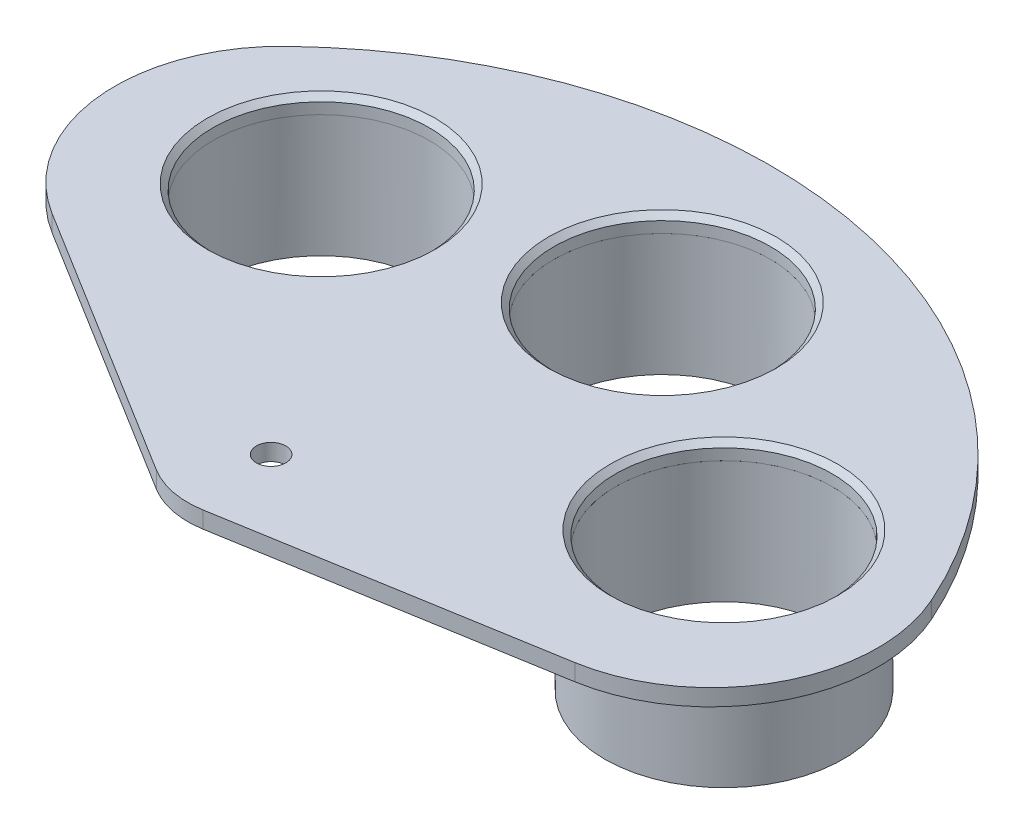
ISO-10303-21;
HEADER;
FILE_DESCRIPTION(('STEP AP214'),'2;1');
FILE_NAME('part.step','',(''),(''),'','','');
FILE_SCHEMA(('AUTOMOTIVE_DESIGN { 1 0 10303 214 1 1 1 1 }'));
ENDSEC;
DATA;
#1=APPLICATION_CONTEXT('core data for automotive mechanical design processes');
#2=APPLICATION_PROTOCOL_DEFINITION('international standard','automotive_design',2000,#1);
#3=PRODUCT_CONTEXT('',#1,'mechanical');
#4=PRODUCT('Part','Part','',(#3));
#5=PRODUCT_RELATED_PRODUCT_CATEGORY('part','',(#4));
#6=PRODUCT_DEFINITION_FORMATION('','',#4);
#7=PRODUCT_DEFINITION_CONTEXT('part definition',#1,'design');
#8=PRODUCT_DEFINITION('design','',#6,#7);
#9=PRODUCT_DEFINITION_SHAPE('','',#8);
#10=(LENGTH_UNIT() NAMED_UNIT(*) SI_UNIT(.MILLI.,.METRE.));
#11=(NAMED_UNIT(*) PLANE_ANGLE_UNIT() SI_UNIT($,.RADIAN.));
#12=(NAMED_UNIT(*) SI_UNIT($,.STERADIAN.) SOLID_ANGLE_UNIT());
#13=UNCERTAINTY_MEASURE_WITH_UNIT(LENGTH_MEASURE(1.E-05),#10,'distance_accuracy_value','');
#14=(GEOMETRIC_REPRESENTATION_CONTEXT(3) GLOBAL_UNCERTAINTY_ASSIGNED_CONTEXT((#13)) GLOBAL_UNIT_ASSIGNED_CONTEXT((#10,
#11,#12)) REPRESENTATION_CONTEXT('',''));
#15=CARTESIAN_POINT('',(0.,0.,0.));
#16=DIRECTION('',(0.,0.,1.));
#17=DIRECTION('',(1.,0.,0.));
#18=AXIS2_PLACEMENT_3D('',#15,#16,#17);
#19=CARTESIAN_POINT('',(52.526183946676,-3.,-28.9999999999992));
#20=DIRECTION('',(0.,1.,0.));
#21=DIRECTION('',(-0.984807753012207,0.,-0.173648177666934));
#22=AXIS2_PLACEMENT_3D('',#19,#20,#21);
#23=PLANE('',#22);
#24=CARTESIAN_POINT('',(52.526183946676,-3.,-28.9999999999992));
#25=DIRECTION('',(0.,1.,0.));
#26=DIRECTION('',(-0.984807753012207,0.,-0.173648177666934));
#27=AXIS2_PLACEMENT_3D('',#24,#25,#26);
#28=CIRCLE('',#27,24.);
#29=CARTESIAN_POINT('',(28.890797874383,-3.,-33.1675562640056));
#30=VERTEX_POINT('',#29);
#31=EDGE_CURVE('E61',#30,#30,#28,.T.);
#32=ORIENTED_EDGE('',*,*,#31,.F.);
#33=EDGE_LOOP('',(#32));
#34=FACE_BOUND('',#33,.T.);
#35=CARTESIAN_POINT('',(52.526183946676,-3.,-28.9999999999992));
#36=DIRECTION('',(0.,1.,0.));
#37=DIRECTION('',(-0.984807753012207,0.,-0.173648177666934));
#38=AXIS2_PLACEMENT_3D('',#35,#36,#37);
#39=CIRCLE('',#38,21.4999999999999);
#40=CARTESIAN_POINT('',(31.3528172569136,-3.,-32.7334358198383));
#41=VERTEX_POINT('',#40);
#42=EDGE_CURVE('E11',#41,#41,#39,.F.);
#43=ORIENTED_EDGE('',*,*,#42,.F.);
#44=EDGE_LOOP('',(#43));
#45=FACE_BOUND('',#44,.T.);
#46=ADVANCED_FACE('F52',(#34,#45),#23,.F.);
#47=CARTESIAN_POINT('',(52.526183946676,-3.,-28.9999999999992));
#48=DIRECTION('',(0.,1.,0.));
#49=DIRECTION('',(-0.984807753012207,0.,-0.173648177666934));
#50=AXIS2_PLACEMENT_3D('',#47,#48,#49);
#51=CYLINDRICAL_SURFACE('',#50,24.);
#52=ORIENTED_EDGE('',*,*,#31,.T.);
#53=EDGE_LOOP('',(#52));
#54=FACE_BOUND('',#53,.T.);
#55=CARTESIAN_POINT('',(52.526183946676,0.,-28.9999999999992));
#56=DIRECTION('',(0.,1.,0.));
#57=DIRECTION('',(-0.984807753012207,0.,-0.173648177666934));
#58=AXIS2_PLACEMENT_3D('',#55,#56,#57);
#59=CIRCLE('',#58,24.);
#60=CARTESIAN_POINT('',(28.890797874383,0.,-33.1675562640056));
#61=VERTEX_POINT('',#60);
#62=EDGE_CURVE('E56',#61,#61,#59,.T.);
#63=ORIENTED_EDGE('',*,*,#62,.F.);
#64=EDGE_LOOP('',(#63));
#65=FACE_BOUND('',#64,.T.);
#66=ADVANCED_FACE('F54',(#54,#65),#51,.T.);
#67=CARTESIAN_POINT('',(52.526183946676,0.,-28.9999999999992));
#68=DIRECTION('',(0.,1.,0.));
#69=DIRECTION('',(-0.984807753012207,0.,-0.173648177666934));
#70=AXIS2_PLACEMENT_3D('',#67,#68,#69);
#71=PLANE('',#70);
#72=CARTESIAN_POINT('',(52.526183946676,0.,-28.9999999999992));
#73=DIRECTION('',(0.,1.,0.));
#74=DIRECTION('',(-0.984807753012207,0.,-0.173648177666934));
#75=AXIS2_PLACEMENT_3D('',#72,#73,#74);
#76=CIRCLE('',#75,19.4999999999999);
#77=CARTESIAN_POINT('',(33.322432762938,0.,-32.3861394645044));
#78=VERTEX_POINT('',#77);
#79=EDGE_CURVE('E73',#78,#78,#76,.T.);
#80=ORIENTED_EDGE('',*,*,#79,.F.);
#81=EDGE_LOOP('',(#80));
#82=FACE_BOUND('',#81,.T.);
#83=ORIENTED_EDGE('',*,*,#62,.T.);
#84=EDGE_LOOP('',(#83));
#85=FACE_BOUND('',#84,.T.);
#86=ADVANCED_FACE('F104',(#82,#85),#71,.T.);
#87=CARTESIAN_POINT('',(52.526183946676,-3.,-28.9999999999992));
#88=DIRECTION('',(0.,1.,0.));
#89=DIRECTION('',(-0.984807753012207,0.,-0.173648177666934));
#90=AXIS2_PLACEMENT_3D('',#87,#88,#89);
#91=CYLINDRICAL_SURFACE('',#90,19.4999999999999);
#92=ORIENTED_EDGE('',*,*,#79,.T.);
#93=EDGE_LOOP('',(#92));
#94=FACE_BOUND('',#93,.T.);
#95=CARTESIAN_POINT('',(52.526183946676,-22.,-28.9999999999992));
#96=DIRECTION('',(0.,-1.,0.));
#97=DIRECTION('',(0.984807753012207,0.,0.173648177666934));
#98=AXIS2_PLACEMENT_3D('',#95,#96,#97);
#99=CIRCLE('',#98,19.4999999999999);
#100=CARTESIAN_POINT('',(71.7299351304139,-22.,-25.613860535494));
#101=VERTEX_POINT('',#100);
#102=EDGE_CURVE('E80',#101,#101,#99,.T.);
#103=ORIENTED_EDGE('',*,*,#102,.T.);
#104=EDGE_LOOP('',(#103));
#105=FACE_BOUND('',#104,.T.);
#106=ADVANCED_FACE('F87',(#94,#105),#91,.F.);
#107=CARTESIAN_POINT('',(52.526183946676,-22.,-28.9999999999992));
#108=DIRECTION('',(0.,1.,0.));
#109=DIRECTION('',(-0.984807753012207,0.,-0.173648177666934));
#110=AXIS2_PLACEMENT_3D('',#107,#108,#109);
#111=CYLINDRICAL_SURFACE('',#110,21.4999999999999);
#112=CARTESIAN_POINT('',(52.526183946676,-22.,-28.9999999999992));
#113=DIRECTION('',(0.,-1.,0.));
#114=DIRECTION('',(0.984807753012207,0.,0.173648177666934));
#115=AXIS2_PLACEMENT_3D('',#112,#113,#114);
#116=CIRCLE('',#115,21.4999999999999);
#117=CARTESIAN_POINT('',(73.6995506364384,-22.,-25.2665641801601));
#118=VERTEX_POINT('',#117);
#119=EDGE_CURVE('E71',#118,#118,#116,.T.);
#120=ORIENTED_EDGE('',*,*,#119,.F.);
#121=EDGE_LOOP('',(#120));
#122=FACE_BOUND('',#121,.T.);
#123=ORIENTED_EDGE('',*,*,#42,.T.);
#124=EDGE_LOOP('',(#123));
#125=FACE_BOUND('',#124,.T.);
#126=ADVANCED_FACE('F91',(#122,#125),#111,.T.);
#127=CARTESIAN_POINT('',(52.526183946676,-22.,-28.9999999999992));
#128=DIRECTION('',(0.,-1.,0.));
#129=DIRECTION('',(0.984807753012207,0.,0.173648177666934));
#130=AXIS2_PLACEMENT_3D('',#127,#128,#129);
#131=PLANE('',#130);
#132=ORIENTED_EDGE('',*,*,#119,.T.);
#133=EDGE_LOOP('',(#132));
#134=FACE_BOUND('',#133,.T.);
#135=ORIENTED_EDGE('',*,*,#102,.F.);
#136=EDGE_LOOP('',(#135));
#137=FACE_BOUND('',#136,.T.);
#138=ADVANCED_FACE('F89',(#134,#137),#131,.T.);
#139=CLOSED_SHELL('',(#46,#66,#86,#106,#126,#138));
#140=MANIFOLD_SOLID_BREP('B2',#139);
#141=CARTESIAN_POINT('',(11.5478913745895,-3.,-58.8782320115056));
#142=DIRECTION('',(0.,1.,0.));
#143=DIRECTION('',(-0.766044443118979,0.,0.642787609686538));
#144=AXIS2_PLACEMENT_3D('',#141,#142,#143);
#145=PLANE('',#144);
#146=CARTESIAN_POINT('',(11.5478913745895,-3.,-58.8782320115056));
#147=DIRECTION('',(0.,1.,0.));
#148=DIRECTION('',(-0.766044443118979,0.,0.642787609686538));
#149=AXIS2_PLACEMENT_3D('',#146,#147,#148);
#150=CIRCLE('',#149,24.);
#151=CARTESIAN_POINT('',(-6.837175260266,-3.,-43.4513293790287));
#152=VERTEX_POINT('',#151);
#153=EDGE_CURVE('E173',#152,#152,#150,.T.);
#154=ORIENTED_EDGE('',*,*,#153,.F.);
#155=EDGE_LOOP('',(#154));
#156=FACE_BOUND('',#155,.T.);
#157=CARTESIAN_POINT('',(11.5478913745895,-3.,-58.8782320115056));
#158=DIRECTION('',(0.,1.,0.));
#159=DIRECTION('',(-0.766044443118979,0.,0.642787609686538));
#160=AXIS2_PLACEMENT_3D('',#157,#158,#159);
#161=CIRCLE('',#160,21.4999999999999);
#162=CARTESIAN_POINT('',(-4.92206415246851,-3.,-45.0582984032451));
#163=VERTEX_POINT('',#162);
#164=EDGE_CURVE('E51',#163,#163,#161,.F.);
#165=ORIENTED_EDGE('',*,*,#164,.F.);
#166=EDGE_LOOP('',(#165));
#167=FACE_BOUND('',#166,.T.);
#168=ADVANCED_FACE('F164',(#156,#167),#145,.F.);
#169=CARTESIAN_POINT('',(11.5478913745895,-3.,-58.8782320115056));
#170=DIRECTION('',(0.,1.,0.));
#171=DIRECTION('',(-0.766044443118979,0.,0.642787609686538));
#172=AXIS2_PLACEMENT_3D('',#169,#170,#171);
#173=CYLINDRICAL_SURFACE('',#172,24.);
#174=ORIENTED_EDGE('',*,*,#153,.T.);
#175=EDGE_LOOP('',(#174));
#176=FACE_BOUND('',#175,.T.);
#177=CARTESIAN_POINT('',(11.5478913745895,0.,-58.8782320115056));
#178=DIRECTION('',(0.,1.,0.));
#179=DIRECTION('',(-0.766044443118979,0.,0.642787609686538));
#180=AXIS2_PLACEMENT_3D('',#177,#178,#179);
#181=CIRCLE('',#180,24.);
#182=CARTESIAN_POINT('',(-6.837175260266,0.,-43.4513293790287));
#183=VERTEX_POINT('',#182);
#184=EDGE_CURVE('E168',#183,#183,#181,.T.);
#185=ORIENTED_EDGE('',*,*,#184,.F.);
#186=EDGE_LOOP('',(#185));
#187=FACE_BOUND('',#186,.T.);
#188=ADVANCED_FACE('F166',(#176,#187),#173,.T.);
#189=CARTESIAN_POINT('',(11.5478913745895,0.,-58.8782320115056));
#190=DIRECTION('',(0.,1.,0.));
#191=DIRECTION('',(-0.766044443118979,0.,0.642787609686538));
#192=AXIS2_PLACEMENT_3D('',#189,#190,#191);
#193=PLANE('',#192);
#194=CARTESIAN_POINT('',(11.5478913745895,0.,-58.8782320115056));
#195=DIRECTION('',(0.,1.,0.));
#196=DIRECTION('',(-0.766044443118979,0.,0.642787609686538));
#197=AXIS2_PLACEMENT_3D('',#194,#195,#196);
#198=CIRCLE('',#197,19.4999999999999);
#199=CARTESIAN_POINT('',(-3.38997526623055,0.,-46.3438736226181));
#200=VERTEX_POINT('',#199);
#201=EDGE_CURVE('E184',#200,#200,#198,.T.);
#202=ORIENTED_EDGE('',*,*,#201,.F.);
#203=EDGE_LOOP('',(#202));
#204=FACE_BOUND('',#203,.T.);
#205=ORIENTED_EDGE('',*,*,#184,.T.);
#206=EDGE_LOOP('',(#205));
#207=FACE_BOUND('',#206,.T.);
#208=ADVANCED_FACE('F216',(#204,#207),#193,.T.);
#209=CARTESIAN_POINT('',(11.5478913745895,-3.,-58.8782320115056));
#210=DIRECTION('',(0.,1.,0.));
#211=DIRECTION('',(-0.766044443118979,0.,0.642787609686538));
#212=AXIS2_PLACEMENT_3D('',#209,#210,#211);
#213=CYLINDRICAL_SURFACE('',#212,19.4999999999999);
#214=ORIENTED_EDGE('',*,*,#201,.T.);
#215=EDGE_LOOP('',(#214));
#216=FACE_BOUND('',#215,.T.);
#217=CARTESIAN_POINT('',(11.5478913745895,-22.,-58.8782320115056));
#218=DIRECTION('',(0.,-1.,0.));
#219=DIRECTION('',(0.766044443118979,0.,-0.642787609686538));
#220=AXIS2_PLACEMENT_3D('',#217,#218,#219);
#221=CIRCLE('',#220,19.4999999999999);
#222=CARTESIAN_POINT('',(26.4857580154095,-22.,-71.412590400393));
#223=VERTEX_POINT('',#222);
#224=EDGE_CURVE('E192',#223,#223,#221,.T.);
#225=ORIENTED_EDGE('',*,*,#224,.T.);
#226=EDGE_LOOP('',(#225));
#227=FACE_BOUND('',#226,.T.);
#228=ADVANCED_FACE('F199',(#216,#227),#213,.F.);
#229=CARTESIAN_POINT('',(11.5478913745895,-22.,-58.8782320115056));
#230=DIRECTION('',(0.,1.,0.));
#231=DIRECTION('',(-0.766044443118979,0.,0.642787609686538));
#232=AXIS2_PLACEMENT_3D('',#229,#230,#231);
#233=CYLINDRICAL_SURFACE('',#232,21.4999999999999);
#234=CARTESIAN_POINT('',(11.5478913745895,-22.,-58.8782320115056));
#235=DIRECTION('',(0.,-1.,0.));
#236=DIRECTION('',(0.766044443118979,0.,-0.642787609686538));
#237=AXIS2_PLACEMENT_3D('',#234,#235,#236);
#238=CIRCLE('',#237,21.4999999999999);
#239=CARTESIAN_POINT('',(28.0178469016475,-22.,-72.6981656197661));
#240=VERTEX_POINT('',#239);
#241=EDGE_CURVE('E182',#240,#240,#238,.T.);
#242=ORIENTED_EDGE('',*,*,#241,.F.);
#243=EDGE_LOOP('',(#242));
#244=FACE_BOUND('',#243,.T.);
#245=ORIENTED_EDGE('',*,*,#164,.T.);
#246=EDGE_LOOP('',(#245));
#247=FACE_BOUND('',#246,.T.);
#248=ADVANCED_FACE('F203',(#244,#247),#233,.T.);
#249=CARTESIAN_POINT('',(11.5478913745895,-22.,-58.8782320115056));
#250=DIRECTION('',(0.,-1.,0.));
#251=DIRECTION('',(0.766044443118979,0.,-0.642787609686538));
#252=AXIS2_PLACEMENT_3D('',#249,#250,#251);
#253=PLANE('',#252);
#254=ORIENTED_EDGE('',*,*,#241,.T.);
#255=EDGE_LOOP('',(#254));
#256=FACE_BOUND('',#255,.T.);
#257=ORIENTED_EDGE('',*,*,#224,.F.);
#258=EDGE_LOOP('',(#257));
#259=FACE_BOUND('',#258,.T.);
#260=ADVANCED_FACE('F201',(#256,#259),#253,.T.);
#261=CLOSED_SHELL('',(#168,#188,#208,#228,#248,#260));
#262=MANIFOLD_SOLID_BREP('B6',#261);
#263=CARTESIAN_POINT('',(-37.6805009594917,-3.,-46.6923960344909));
#264=DIRECTION('',(0.,1.,0.));
#265=DIRECTION('',(0.,0.,1.));
#266=AXIS2_PLACEMENT_3D('',#263,#264,#265);
#267=PLANE('',#266);
#268=CARTESIAN_POINT('',(-37.6805009594917,-3.,-46.6923960344909));
#269=DIRECTION('',(0.,1.,0.));
#270=DIRECTION('',(0.,0.,1.));
#271=AXIS2_PLACEMENT_3D('',#268,#269,#270);
#272=CIRCLE('',#271,24.);
#273=CARTESIAN_POINT('',(-37.6805009594917,-3.,-22.6923960344909));
#274=VERTEX_POINT('',#273);
#275=EDGE_CURVE('E287',#274,#274,#272,.T.);
#276=ORIENTED_EDGE('',*,*,#275,.F.);
#277=EDGE_LOOP('',(#276));
#278=FACE_BOUND('',#277,.T.);
#279=CARTESIAN_POINT('',(-37.6805009594917,-3.,-46.6923960344909));
#280=DIRECTION('',(0.,1.,0.));
#281=DIRECTION('',(0.,0.,1.));
#282=AXIS2_PLACEMENT_3D('',#279,#280,#281);
#283=CIRCLE('',#282,21.4999999999999);
#284=CARTESIAN_POINT('',(-37.6805009594917,-3.,-25.192396034491));
#285=VERTEX_POINT('',#284);
#286=EDGE_CURVE('E163',#285,#285,#283,.F.);
#287=ORIENTED_EDGE('',*,*,#286,.F.);
#288=EDGE_LOOP('',(#287));
#289=FACE_BOUND('',#288,.T.);
#290=ADVANCED_FACE('F278',(#278,#289),#267,.F.);
#291=CARTESIAN_POINT('',(-37.6805009594917,-3.,-46.6923960344909));
#292=DIRECTION('',(0.,1.,0.));
#293=DIRECTION('',(0.,0.,1.));
#294=AXIS2_PLACEMENT_3D('',#291,#292,#293);
#295=CYLINDRICAL_SURFACE('',#294,24.);
#296=ORIENTED_EDGE('',*,*,#275,.T.);
#297=EDGE_LOOP('',(#296));
#298=FACE_BOUND('',#297,.T.);
#299=CARTESIAN_POINT('',(-37.6805009594917,0.,-46.6923960344909));
#300=DIRECTION('',(0.,1.,0.));
#301=DIRECTION('',(0.,0.,1.));
#302=AXIS2_PLACEMENT_3D('',#299,#300,#301);
#303=CIRCLE('',#302,24.);
#304=CARTESIAN_POINT('',(-37.6805009594917,0.,-22.6923960344909));
#305=VERTEX_POINT('',#304);
#306=EDGE_CURVE('E282',#305,#305,#303,.T.);
#307=ORIENTED_EDGE('',*,*,#306,.F.);
#308=EDGE_LOOP('',(#307));
#309=FACE_BOUND('',#308,.T.);
#310=ADVANCED_FACE('F280',(#298,#309),#295,.T.);
#311=CARTESIAN_POINT('',(-37.6805009594917,0.,-46.6923960344909));
#312=DIRECTION('',(0.,1.,0.));
#313=DIRECTION('',(0.,0.,1.));
#314=AXIS2_PLACEMENT_3D('',#311,#312,#313);
#315=PLANE('',#314);
#316=CARTESIAN_POINT('',(-37.6805009594917,0.,-46.6923960344909));
#317=DIRECTION('',(0.,1.,0.));
#318=DIRECTION('',(0.,0.,1.));
#319=AXIS2_PLACEMENT_3D('',#316,#317,#318);
#320=CIRCLE('',#319,19.4999999999999);
#321=CARTESIAN_POINT('',(-37.6805009594917,0.,-27.192396034491));
#322=VERTEX_POINT('',#321);
#323=EDGE_CURVE('E298',#322,#322,#320,.T.);
#324=ORIENTED_EDGE('',*,*,#323,.F.);
#325=EDGE_LOOP('',(#324));
#326=FACE_BOUND('',#325,.T.);
#327=ORIENTED_EDGE('',*,*,#306,.T.);
#328=EDGE_LOOP('',(#327));
#329=FACE_BOUND('',#328,.T.);
#330=ADVANCED_FACE('F330',(#326,#329),#315,.T.);
#331=CARTESIAN_POINT('',(-37.6805009594917,-3.,-46.6923960344909));
#332=DIRECTION('',(0.,1.,0.));
#333=DIRECTION('',(0.,0.,1.));
#334=AXIS2_PLACEMENT_3D('',#331,#332,#333);
#335=CYLINDRICAL_SURFACE('',#334,19.4999999999999);
#336=ORIENTED_EDGE('',*,*,#323,.T.);
#337=EDGE_LOOP('',(#336));
#338=FACE_BOUND('',#337,.T.);
#339=CARTESIAN_POINT('',(-37.6805009594917,-22.,-46.6923960344909));
#340=DIRECTION('',(0.,-1.,0.));
#341=DIRECTION('',(0.,0.,-1.));
#342=AXIS2_PLACEMENT_3D('',#339,#340,#341);
#343=CIRCLE('',#342,19.4999999999999);
#344=CARTESIAN_POINT('',(-37.6805009594917,-22.,-66.1923960344908));
#345=VERTEX_POINT('',#344);
#346=EDGE_CURVE('E306',#345,#345,#343,.T.);
#347=ORIENTED_EDGE('',*,*,#346,.T.);
#348=EDGE_LOOP('',(#347));
#349=FACE_BOUND('',#348,.T.);
#350=ADVANCED_FACE('F313',(#338,#349),#335,.F.);
#351=CARTESIAN_POINT('',(-37.6805009594917,-22.,-46.6923960344909));
#352=DIRECTION('',(0.,1.,0.));
#353=DIRECTION('',(0.,0.,1.));
#354=AXIS2_PLACEMENT_3D('',#351,#352,#353);
#355=CYLINDRICAL_SURFACE('',#354,21.4999999999999);
#356=CARTESIAN_POINT('',(-37.6805009594917,-22.,-46.6923960344909));
#357=DIRECTION('',(0.,-1.,0.));
#358=DIRECTION('',(0.,0.,-1.));
#359=AXIS2_PLACEMENT_3D('',#356,#357,#358);
#360=CIRCLE('',#359,21.4999999999999);
#361=CARTESIAN_POINT('',(-37.6805009594917,-22.,-68.1923960344909));
#362=VERTEX_POINT('',#361);
#363=EDGE_CURVE('E296',#362,#362,#360,.T.);
#364=ORIENTED_EDGE('',*,*,#363,.F.);
#365=EDGE_LOOP('',(#364));
#366=FACE_BOUND('',#365,.T.);
#367=ORIENTED_EDGE('',*,*,#286,.T.);
#368=EDGE_LOOP('',(#367));
#369=FACE_BOUND('',#368,.T.);
#370=ADVANCED_FACE('F317',(#366,#369),#355,.T.);
#371=CARTESIAN_POINT('',(-37.6805009594917,-22.,-46.6923960344909));
#372=DIRECTION('',(0.,-1.,0.));
#373=DIRECTION('',(0.,0.,-1.));
#374=AXIS2_PLACEMENT_3D('',#371,#372,#373);
#375=PLANE('',#374);
#376=ORIENTED_EDGE('',*,*,#363,.T.);
#377=EDGE_LOOP('',(#376));
#378=FACE_BOUND('',#377,.T.);
#379=ORIENTED_EDGE('',*,*,#346,.F.);
#380=EDGE_LOOP('',(#379));
#381=FACE_BOUND('',#380,.T.);
#382=ADVANCED_FACE('F315',(#378,#381),#375,.T.);
#383=CLOSED_SHELL('',(#290,#310,#330,#350,#370,#382));
#384=MANIFOLD_SOLID_BREP('B46',#383);
#385=CARTESIAN_POINT('',(0.,3.,0.));
#386=DIRECTION('',(0.,1.,0.));
#387=DIRECTION('',(0.,0.,1.));
#388=AXIS2_PLACEMENT_3D('',#385,#386,#387);
#389=PLANE('',#388);
#390=CARTESIAN_POINT('',(0.,3.,-2.39519101339233E-13));
#391=DIRECTION('',(0.,1.,0.));
#392=DIRECTION('',(0.,0.,1.));
#393=AXIS2_PLACEMENT_3D('',#390,#391,#392);
#394=CIRCLE('',#393,2.65);
#395=CARTESIAN_POINT('',(0.,3.,2.64999999999976));
#396=VERTEX_POINT('',#395);
#397=EDGE_CURVE('E610',#396,#396,#394,.T.);
#398=ORIENTED_EDGE('',*,*,#397,.F.);
#399=EDGE_LOOP('',(#398));
#400=FACE_BOUND('',#399,.T.);
#401=CARTESIAN_POINT('',(52.5261839466756,3.,-29.));
#402=DIRECTION('',(0.,1.,0.));
#403=DIRECTION('',(0.,0.,1.));
#404=AXIS2_PLACEMENT_3D('',#401,#402,#403);
#405=CIRCLE('',#404,20.5);
#406=CARTESIAN_POINT('',(52.5261839466756,3.,-8.50000000000004));
#407=VERTEX_POINT('',#406);
#408=EDGE_CURVE('E517',#407,#407,#405,.F.);
#409=ORIENTED_EDGE('',*,*,#408,.T.);
#410=EDGE_LOOP('',(#409));
#411=FACE_BOUND('',#410,.T.);
#412=CARTESIAN_POINT('',(11.5478913745889,3.,-58.8782320115059));
#413=DIRECTION('',(0.,1.,0.));
#414=DIRECTION('',(0.,0.,1.));
#415=AXIS2_PLACEMENT_3D('',#412,#413,#414);
#416=CIRCLE('',#415,20.5);
#417=CARTESIAN_POINT('',(11.5478913745889,3.,-38.3782320115059));
#418=VERTEX_POINT('',#417);
#419=EDGE_CURVE('E513',#418,#418,#416,.F.);
#420=ORIENTED_EDGE('',*,*,#419,.T.);
#421=EDGE_LOOP('',(#420));
#422=FACE_BOUND('',#421,.T.);
#423=CARTESIAN_POINT('',(-37.6805009594917,3.,-46.6923960344909));
#424=DIRECTION('',(0.,1.,0.));
#425=DIRECTION('',(0.,0.,1.));
#426=AXIS2_PLACEMENT_3D('',#423,#424,#425);
#427=CIRCLE('',#426,20.5);
#428=CARTESIAN_POINT('',(-37.6805009594917,3.,-26.192396034491));
#429=VERTEX_POINT('',#428);
#430=EDGE_CURVE('E510',#429,#429,#427,.F.);
#431=ORIENTED_EDGE('',*,*,#430,.T.);
#432=EDGE_LOOP('',(#431));
#433=FACE_BOUND('',#432,.T.);
#434=CARTESIAN_POINT('',(0.,3.,0.));
#435=DIRECTION('',(0.,1.,0.));
#436=DIRECTION('',(0.,0.,1.));
#437=AXIS2_PLACEMENT_3D('',#434,#435,#436);
#438=CIRCLE('',#437,15.);
#439=CARTESIAN_POINT('',(-7.90153303408654,3.,12.7501284586171));
#440=VERTEX_POINT('',#439);
#441=CARTESIAN_POINT('',(2.5,3.,14.790199457749));
#442=VERTEX_POINT('',#441);
#443=EDGE_CURVE('E495',#440,#442,#438,.T.);
#444=ORIENTED_EDGE('',*,*,#443,.T.);
#445=DIRECTION('',(0.986013297183269,0.,-0.166666666666667));
#446=VECTOR('',#445,1.);
#447=CARTESIAN_POINT('',(2.5,3.,14.790199457749));
#448=LINE('',#447,#446);
#449=CARTESIAN_POINT('',(59.782196186948,3.,5.10774109223049));
#450=VERTEX_POINT('',#449);
#451=EDGE_CURVE('E444',#442,#450,#448,.T.);
#452=ORIENTED_EDGE('',*,*,#451,.T.);
#453=CARTESIAN_POINT('',(54.782196186948,3.,-24.4726578232676));
#454=DIRECTION('',(0.,1.,0.));
#455=DIRECTION('',(0.,0.,-1.));
#456=AXIS2_PLACEMENT_3D('',#453,#454,#455);
#457=CIRCLE('',#456,30.);
#458=CARTESIAN_POINT('',(82.173294280422,3.,-36.7089867349014));
#459=VERTEX_POINT('',#458);
#460=EDGE_CURVE('E456',#450,#459,#457,.T.);
#461=ORIENTED_EDGE('',*,*,#460,.T.);
#462=CARTESIAN_POINT('',(0.,3.,-2.39519101339233E-13));
#463=DIRECTION('',(0.,1.,0.));
#464=DIRECTION('',(0.,0.,-1.));
#465=AXIS2_PLACEMENT_3D('',#462,#463,#464);
#466=CIRCLE('',#465,89.9999999999999);
#467=CARTESIAN_POINT('',(-62.2192532222144,3.,-65.0289514637132));
#468=VERTEX_POINT('',#467);
#469=EDGE_CURVE('E451',#459,#468,#466,.T.);
#470=ORIENTED_EDGE('',*,*,#469,.T.);
#471=CARTESIAN_POINT('',(-41.4795021481429,3.,-43.3526343091421));
#472=DIRECTION('',(0.,1.,0.));
#473=DIRECTION('',(0.,0.,1.));
#474=AXIS2_PLACEMENT_3D('',#471,#472,#473);
#475=CIRCLE('',#474,30.);
#476=CARTESIAN_POINT('',(-57.282568216316,3.,-17.8523773919078));
#477=VERTEX_POINT('',#476);
#478=EDGE_CURVE('E454',#468,#477,#475,.T.);
#479=ORIENTED_EDGE('',*,*,#478,.T.);
#480=DIRECTION('',(0.85000856390781,0.,0.526768868939103));
#481=VECTOR('',#480,1.);
#482=CARTESIAN_POINT('',(-57.282568216316,3.,-17.8523773919078));
#483=LINE('',#482,#481);
#484=EDGE_CURVE('E403',#477,#440,#483,.T.);
#485=ORIENTED_EDGE('',*,*,#484,.T.);
#486=EDGE_LOOP('',(#444,#452,#461,#470,#479,#485));
#487=FACE_BOUND('',#486,.T.);
#488=ADVANCED_FACE('F381',(#400,#411,#422,#433,#487),#389,.T.);
#489=CARTESIAN_POINT('',(0.,0.,0.));
#490=DIRECTION('',(0.,1.,0.));
#491=DIRECTION('',(0.,0.,1.));
#492=AXIS2_PLACEMENT_3D('',#489,#490,#491);
#493=PLANE('',#492);
#494=CARTESIAN_POINT('',(0.,0.,-2.39519101339233E-13));
#495=DIRECTION('',(0.,1.,0.));
#496=DIRECTION('',(0.,0.,1.));
#497=AXIS2_PLACEMENT_3D('',#494,#495,#496);
#498=CIRCLE('',#497,2.65);
#499=CARTESIAN_POINT('',(0.,0.,2.64999999999976));
#500=VERTEX_POINT('',#499);
#501=EDGE_CURVE('E606',#500,#500,#498,.T.);
#502=ORIENTED_EDGE('',*,*,#501,.T.);
#503=EDGE_LOOP('',(#502));
#504=FACE_BOUND('',#503,.T.);
#505=CARTESIAN_POINT('',(0.,0.,0.));
#506=DIRECTION('',(0.,1.,0.));
#507=DIRECTION('',(0.,0.,1.));
#508=AXIS2_PLACEMENT_3D('',#505,#506,#507);
#509=CIRCLE('',#508,15.);
#510=CARTESIAN_POINT('',(-7.90153303408654,0.,12.7501284586171));
#511=VERTEX_POINT('',#510);
#512=CARTESIAN_POINT('',(2.5,0.,14.790199457749));
#513=VERTEX_POINT('',#512);
#514=EDGE_CURVE('E479',#511,#513,#509,.T.);
#515=ORIENTED_EDGE('',*,*,#514,.F.);
#516=DIRECTION('',(0.85000856390781,0.,0.526768868939103));
#517=VECTOR('',#516,1.);
#518=CARTESIAN_POINT('',(-57.282568216316,0.,-17.8523773919078));
#519=LINE('',#518,#517);
#520=CARTESIAN_POINT('',(-57.282568216316,0.,-17.8523773919078));
#521=VERTEX_POINT('',#520);
#522=EDGE_CURVE('E434',#521,#511,#519,.T.);
#523=ORIENTED_EDGE('',*,*,#522,.F.);
#524=CARTESIAN_POINT('',(-41.4795021481429,0.,-43.3526343091421));
#525=DIRECTION('',(0.,1.,0.));
#526=DIRECTION('',(0.,0.,1.));
#527=AXIS2_PLACEMENT_3D('',#524,#525,#526);
#528=CIRCLE('',#527,30.);
#529=CARTESIAN_POINT('',(-62.2192532222144,0.,-65.0289514637132));
#530=VERTEX_POINT('',#529);
#531=EDGE_CURVE('E428',#530,#521,#528,.T.);
#532=ORIENTED_EDGE('',*,*,#531,.F.);
#533=CARTESIAN_POINT('',(0.,0.,-2.39519101339233E-13));
#534=DIRECTION('',(0.,1.,0.));
#535=DIRECTION('',(0.,0.,-1.));
#536=AXIS2_PLACEMENT_3D('',#533,#534,#535);
#537=CIRCLE('',#536,89.9999999999999);
#538=CARTESIAN_POINT('',(82.173294280422,0.,-36.7089867349014));
#539=VERTEX_POINT('',#538);
#540=EDGE_CURVE('E465',#539,#530,#537,.T.);
#541=ORIENTED_EDGE('',*,*,#540,.F.);
#542=CARTESIAN_POINT('',(54.782196186948,0.,-24.4726578232676));
#543=DIRECTION('',(0.,1.,0.));
#544=DIRECTION('',(0.,0.,-1.));
#545=AXIS2_PLACEMENT_3D('',#542,#543,#544);
#546=CIRCLE('',#545,30.);
#547=CARTESIAN_POINT('',(59.782196186948,0.,5.10774109223049));
#548=VERTEX_POINT('',#547);
#549=EDGE_CURVE('E487',#548,#539,#546,.T.);
#550=ORIENTED_EDGE('',*,*,#549,.F.);
#551=DIRECTION('',(0.986013297183269,0.,-0.166666666666667));
#552=VECTOR('',#551,1.);
#553=CARTESIAN_POINT('',(2.5,0.,14.790199457749));
#554=LINE('',#553,#552);
#555=EDGE_CURVE('E483',#513,#548,#554,.T.);
#556=ORIENTED_EDGE('',*,*,#555,.F.);
#557=EDGE_LOOP('',(#515,#523,#532,#541,#550,#556));
#558=FACE_BOUND('',#557,.T.);
#559=CARTESIAN_POINT('',(-37.6805009594917,0.,-46.6923960344909));
#560=DIRECTION('',(0.,1.,0.));
#561=DIRECTION('',(0.,0.,1.));
#562=AXIS2_PLACEMENT_3D('',#559,#560,#561);
#563=CIRCLE('',#562,19.4999999999999);
#564=CARTESIAN_POINT('',(-37.6805009594917,0.,-27.192396034491));
#565=VERTEX_POINT('',#564);
#566=EDGE_CURVE('E484',#565,#565,#563,.T.);
#567=ORIENTED_EDGE('',*,*,#566,.T.);
#568=EDGE_LOOP('',(#567));
#569=FACE_BOUND('',#568,.T.);
#570=CARTESIAN_POINT('',(11.5478913745889,0.,-58.8782320115059));
#571=DIRECTION('',(0.,1.,0.));
#572=DIRECTION('',(0.,0.,1.));
#573=AXIS2_PLACEMENT_3D('',#570,#571,#572);
#574=CIRCLE('',#573,19.5);
#575=CARTESIAN_POINT('',(11.5478913745889,0.,-39.3782320115059));
#576=VERTEX_POINT('',#575);
#577=EDGE_CURVE('E598',#576,#576,#574,.T.);
#578=ORIENTED_EDGE('',*,*,#577,.T.);
#579=EDGE_LOOP('',(#578));
#580=FACE_BOUND('',#579,.T.);
#581=CARTESIAN_POINT('',(52.5261839466756,0.,-29.));
#582=DIRECTION('',(0.,1.,0.));
#583=DIRECTION('',(0.,0.,1.));
#584=AXIS2_PLACEMENT_3D('',#581,#582,#583);
#585=CIRCLE('',#584,19.5);
#586=CARTESIAN_POINT('',(52.5261839466756,0.,-9.50000000000002));
#587=VERTEX_POINT('',#586);
#588=EDGE_CURVE('E602',#587,#587,#585,.T.);
#589=ORIENTED_EDGE('',*,*,#588,.T.);
#590=EDGE_LOOP('',(#589));
#591=FACE_BOUND('',#590,.T.);
#592=ADVANCED_FACE('F543',(#504,#558,#569,#580,#591),#493,.F.);
#593=CARTESIAN_POINT('',(0.,3.,0.));
#594=DIRECTION('',(0.,-1.,0.));
#595=DIRECTION('',(0.,0.,-1.));
#596=AXIS2_PLACEMENT_3D('',#593,#594,#595);
#597=CYLINDRICAL_SURFACE('',#596,15.);
#598=ORIENTED_EDGE('',*,*,#514,.T.);
#599=DIRECTION('',(0.,-1.,0.));
#600=VECTOR('',#599,1.);
#601=CARTESIAN_POINT('',(2.5,3.,14.790199457749));
#602=LINE('',#601,#600);
#603=EDGE_CURVE('E503',#442,#513,#602,.T.);
#604=ORIENTED_EDGE('',*,*,#603,.F.);
#605=ORIENTED_EDGE('',*,*,#443,.F.);
#606=DIRECTION('',(0.,-1.,0.));
#607=VECTOR('',#606,1.);
#608=CARTESIAN_POINT('',(-7.90153303408654,3.,12.7501284586171));
#609=LINE('',#608,#607);
#610=EDGE_CURVE('E475',#440,#511,#609,.T.);
#611=ORIENTED_EDGE('',*,*,#610,.T.);
#612=EDGE_LOOP('',(#598,#604,#605,#611));
#613=FACE_BOUND('',#612,.T.);
#614=ADVANCED_FACE('F549',(#613),#597,.T.);
#615=CARTESIAN_POINT('',(2.5,3.,14.790199457749));
#616=DIRECTION('',(-0.166666666666667,0.,-0.986013297183269));
#617=DIRECTION('',(-0.986013297183269,0.,0.166666666666667));
#618=AXIS2_PLACEMENT_3D('',#615,#616,#617);
#619=PLANE('',#618);
#620=ORIENTED_EDGE('',*,*,#555,.T.);
#621=DIRECTION('',(0.,-1.,0.));
#622=VECTOR('',#621,1.);
#623=CARTESIAN_POINT('',(59.782196186948,3.,5.10774109223049));
#624=LINE('',#623,#622);
#625=EDGE_CURVE('E500',#450,#548,#624,.T.);
#626=ORIENTED_EDGE('',*,*,#625,.F.);
#627=ORIENTED_EDGE('',*,*,#451,.F.);
#628=ORIENTED_EDGE('',*,*,#603,.T.);
#629=EDGE_LOOP('',(#620,#626,#627,#628));
#630=FACE_BOUND('',#629,.T.);
#631=ADVANCED_FACE('F568',(#630),#619,.F.);
#632=CARTESIAN_POINT('',(54.782196186948,3.,-24.4726578232676));
#633=DIRECTION('',(0.,-1.,0.));
#634=DIRECTION('',(0.,0.,-1.));
#635=AXIS2_PLACEMENT_3D('',#632,#633,#634);
#636=CYLINDRICAL_SURFACE('',#635,30.);
#637=ORIENTED_EDGE('',*,*,#549,.T.);
#638=DIRECTION('',(0.,-1.,0.));
#639=VECTOR('',#638,1.);
#640=CARTESIAN_POINT('',(82.173294280422,3.,-36.7089867349014));
#641=LINE('',#640,#639);
#642=EDGE_CURVE('E466',#459,#539,#641,.T.);
#643=ORIENTED_EDGE('',*,*,#642,.F.);
#644=ORIENTED_EDGE('',*,*,#460,.F.);
#645=ORIENTED_EDGE('',*,*,#625,.T.);
#646=EDGE_LOOP('',(#637,#643,#644,#645));
#647=FACE_BOUND('',#646,.T.);
#648=ADVANCED_FACE('F565',(#647),#636,.T.);
#649=CARTESIAN_POINT('',(0.,3.,-2.39519101339233E-13));
#650=DIRECTION('',(0.,-1.,0.));
#651=DIRECTION('',(0.,0.,-1.));
#652=AXIS2_PLACEMENT_3D('',#649,#650,#651);
#653=CYLINDRICAL_SURFACE('',#652,89.9999999999999);
#654=ORIENTED_EDGE('',*,*,#540,.T.);
#655=DIRECTION('',(0.,-1.,0.));
#656=VECTOR('',#655,1.);
#657=CARTESIAN_POINT('',(-62.2192532222144,3.,-65.0289514637132));
#658=LINE('',#657,#656);
#659=EDGE_CURVE('E462',#468,#530,#658,.T.);
#660=ORIENTED_EDGE('',*,*,#659,.F.);
#661=ORIENTED_EDGE('',*,*,#469,.F.);
#662=ORIENTED_EDGE('',*,*,#642,.T.);
#663=EDGE_LOOP('',(#654,#660,#661,#662));
#664=FACE_BOUND('',#663,.T.);
#665=ADVANCED_FACE('F463',(#664),#653,.T.);
#666=CARTESIAN_POINT('',(-41.4795021481429,3.,-43.3526343091421));
#667=DIRECTION('',(0.,-1.,0.));
#668=DIRECTION('',(0.,0.,-1.));
#669=AXIS2_PLACEMENT_3D('',#666,#667,#668);
#670=CYLINDRICAL_SURFACE('',#669,30.);
#671=ORIENTED_EDGE('',*,*,#531,.T.);
#672=DIRECTION('',(0.,-1.,0.));
#673=VECTOR('',#672,1.);
#674=CARTESIAN_POINT('',(-57.282568216316,3.,-17.8523773919078));
#675=LINE('',#674,#673);
#676=EDGE_CURVE('E467',#477,#521,#675,.T.);
#677=ORIENTED_EDGE('',*,*,#676,.F.);
#678=ORIENTED_EDGE('',*,*,#478,.F.);
#679=ORIENTED_EDGE('',*,*,#659,.T.);
#680=EDGE_LOOP('',(#671,#677,#678,#679));
#681=FACE_BOUND('',#680,.T.);
#682=ADVANCED_FACE('F469',(#681),#670,.T.);
#683=CARTESIAN_POINT('',(-57.282568216316,3.,-17.8523773919078));
#684=DIRECTION('',(0.526768868939103,0.,-0.85000856390781));
#685=DIRECTION('',(-0.85000856390781,0.,-0.526768868939103));
#686=AXIS2_PLACEMENT_3D('',#683,#684,#685);
#687=PLANE('',#686);
#688=ORIENTED_EDGE('',*,*,#522,.T.);
#689=ORIENTED_EDGE('',*,*,#610,.F.);
#690=ORIENTED_EDGE('',*,*,#484,.F.);
#691=ORIENTED_EDGE('',*,*,#676,.T.);
#692=EDGE_LOOP('',(#688,#689,#690,#691));
#693=FACE_BOUND('',#692,.T.);
#694=ADVANCED_FACE('F558',(#693),#687,.F.);
#695=CARTESIAN_POINT('',(-37.6805009594917,3.,-46.6923960344909));
#696=DIRECTION('',(0.,-1.,0.));
#697=DIRECTION('',(0.,0.,-1.));
#698=AXIS2_PLACEMENT_3D('',#695,#696,#697);
#699=CYLINDRICAL_SURFACE('',#698,19.4999999999999);
#700=CARTESIAN_POINT('',(-37.6805009594917,1.99999999999997,-46.6923960344909));
#701=DIRECTION('',(0.,1.,0.));
#702=DIRECTION('',(0.,0.,1.));
#703=AXIS2_PLACEMENT_3D('',#700,#701,#702);
#704=CIRCLE('',#703,19.4999999999999);
#705=CARTESIAN_POINT('',(-37.6805009594917,1.99999999999997,-27.192396034491));
#706=VERTEX_POINT('',#705);
#707=EDGE_CURVE('E276',#706,#706,#704,.T.);
#708=ORIENTED_EDGE('',*,*,#707,.T.);
#709=EDGE_LOOP('',(#708));
#710=FACE_BOUND('',#709,.T.);
#711=ORIENTED_EDGE('',*,*,#566,.F.);
#712=EDGE_LOOP('',(#711));
#713=FACE_BOUND('',#712,.T.);
#714=ADVANCED_FACE('F555',(#710,#713),#699,.F.);
#715=CARTESIAN_POINT('',(11.5478913745889,3.,-58.8782320115059));
#716=DIRECTION('',(0.,-1.,0.));
#717=DIRECTION('',(0.,0.,-1.));
#718=AXIS2_PLACEMENT_3D('',#715,#716,#717);
#719=CYLINDRICAL_SURFACE('',#718,19.5);
#720=CARTESIAN_POINT('',(11.5478913745889,1.99999999999997,-58.8782320115059));
#721=DIRECTION('',(0.,1.,0.));
#722=DIRECTION('',(0.,0.,1.));
#723=AXIS2_PLACEMENT_3D('',#720,#721,#722);
#724=CIRCLE('',#723,19.5);
#725=CARTESIAN_POINT('',(11.5478913745889,1.99999999999997,-39.3782320115059));
#726=VERTEX_POINT('',#725);
#727=EDGE_CURVE('E392',#726,#726,#724,.T.);
#728=ORIENTED_EDGE('',*,*,#727,.T.);
#729=EDGE_LOOP('',(#728));
#730=FACE_BOUND('',#729,.T.);
#731=ORIENTED_EDGE('',*,*,#577,.F.);
#732=EDGE_LOOP('',(#731));
#733=FACE_BOUND('',#732,.T.);
#734=ADVANCED_FACE('F524',(#730,#733),#719,.F.);
#735=CARTESIAN_POINT('',(52.5261839466756,3.,-29.));
#736=DIRECTION('',(0.,-1.,0.));
#737=DIRECTION('',(0.,0.,-1.));
#738=AXIS2_PLACEMENT_3D('',#735,#736,#737);
#739=CYLINDRICAL_SURFACE('',#738,19.5);
#740=CARTESIAN_POINT('',(52.5261839466756,2.,-29.));
#741=DIRECTION('',(0.,1.,0.));
#742=DIRECTION('',(0.,0.,1.));
#743=AXIS2_PLACEMENT_3D('',#740,#741,#742);
#744=CIRCLE('',#743,19.5);
#745=CARTESIAN_POINT('',(52.5261839466756,2.,-9.50000000000002));
#746=VERTEX_POINT('',#745);
#747=EDGE_CURVE('E506',#746,#746,#744,.T.);
#748=ORIENTED_EDGE('',*,*,#747,.T.);
#749=EDGE_LOOP('',(#748));
#750=FACE_BOUND('',#749,.T.);
#751=ORIENTED_EDGE('',*,*,#588,.F.);
#752=EDGE_LOOP('',(#751));
#753=FACE_BOUND('',#752,.T.);
#754=ADVANCED_FACE('F537',(#750,#753),#739,.F.);
#755=CARTESIAN_POINT('',(52.5261839466756,2.,-29.));
#756=DIRECTION('',(0.,1.,0.));
#757=DIRECTION('',(0.,0.,1.));
#758=AXIS2_PLACEMENT_3D('',#755,#756,#757);
#759=CONICAL_SURFACE('',#758,19.5,0.785398163397441);
#760=ORIENTED_EDGE('',*,*,#408,.F.);
#761=EDGE_LOOP('',(#760));
#762=FACE_BOUND('',#761,.T.);
#763=ORIENTED_EDGE('',*,*,#747,.F.);
#764=EDGE_LOOP('',(#763));
#765=FACE_BOUND('',#764,.T.);
#766=ADVANCED_FACE('F529',(#762,#765),#759,.F.);
#767=CARTESIAN_POINT('',(11.5478913745889,1.99999999999997,-58.8782320115059));
#768=DIRECTION('',(0.,1.,0.));
#769=DIRECTION('',(0.,0.,1.));
#770=AXIS2_PLACEMENT_3D('',#767,#768,#769);
#771=CONICAL_SURFACE('',#770,19.5,0.785398163397438);
#772=ORIENTED_EDGE('',*,*,#419,.F.);
#773=EDGE_LOOP('',(#772));
#774=FACE_BOUND('',#773,.T.);
#775=ORIENTED_EDGE('',*,*,#727,.F.);
#776=EDGE_LOOP('',(#775));
#777=FACE_BOUND('',#776,.T.);
#778=ADVANCED_FACE('F527',(#774,#777),#771,.F.);
#779=CARTESIAN_POINT('',(-37.6805009594917,1.99999999999997,-46.6923960344909));
#780=DIRECTION('',(0.,1.,0.));
#781=DIRECTION('',(0.,0.,1.));
#782=AXIS2_PLACEMENT_3D('',#779,#780,#781);
#783=CONICAL_SURFACE('',#782,19.4999999999999,0.785398163397441);
#784=ORIENTED_EDGE('',*,*,#430,.F.);
#785=EDGE_LOOP('',(#784));
#786=FACE_BOUND('',#785,.T.);
#787=ORIENTED_EDGE('',*,*,#707,.F.);
#788=EDGE_LOOP('',(#787));
#789=FACE_BOUND('',#788,.T.);
#790=ADVANCED_FACE('F384',(#786,#789),#783,.F.);
#791=CARTESIAN_POINT('',(0.,3.,-2.39519101339233E-13));
#792=DIRECTION('',(0.,1.,0.));
#793=DIRECTION('',(0.,0.,1.));
#794=AXIS2_PLACEMENT_3D('',#791,#792,#793);
#795=CYLINDRICAL_SURFACE('',#794,2.65);
#796=ORIENTED_EDGE('',*,*,#397,.T.);
#797=EDGE_LOOP('',(#796));
#798=FACE_BOUND('',#797,.T.);
#799=ORIENTED_EDGE('',*,*,#501,.F.);
#800=EDGE_LOOP('',(#799));
#801=FACE_BOUND('',#800,.T.);
#802=ADVANCED_FACE('F535',(#798,#801),#795,.F.);
#803=CLOSED_SHELL('',(#488,#592,#614,#631,#648,#665,#682,#694,#714,#734,#754,#766,#778,#790,#802));
#804=MANIFOLD_SOLID_BREP('B158',#803);
#805=ADVANCED_BREP_SHAPE_REPRESENTATION('',(#18,#140,#262,#384,#804),#14);
#806=SHAPE_DEFINITION_REPRESENTATION(#9,#805);
ENDSEC;
END-ISO-10303-21;
